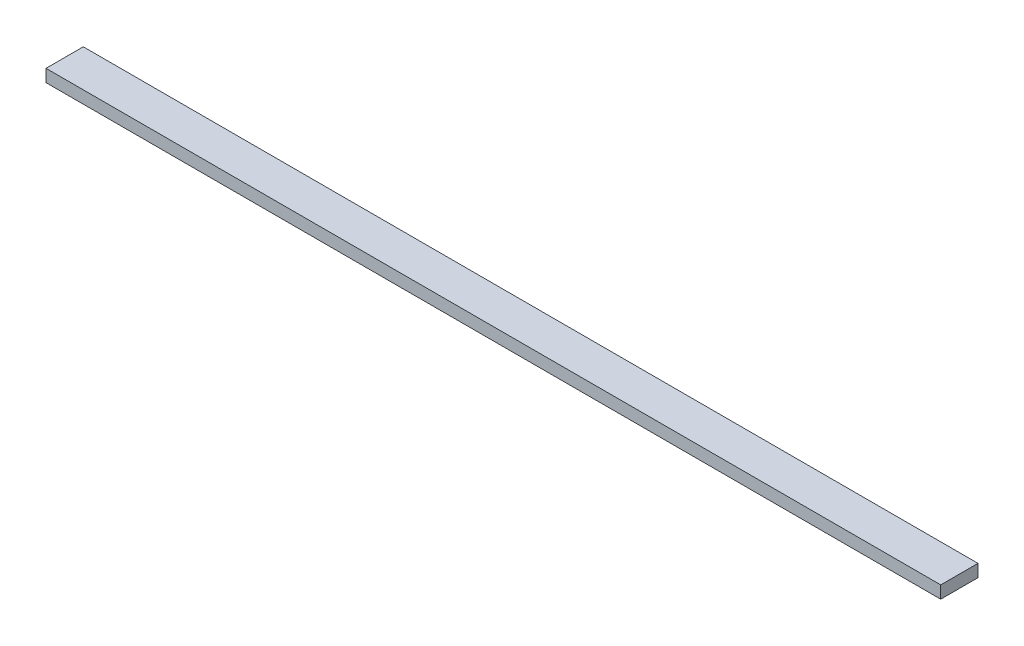
ISO-10303-21;
HEADER;
FILE_DESCRIPTION(('STEP AP214'),'2;1');
FILE_NAME('part.step','',(''),(''),'','','');
FILE_SCHEMA(('AUTOMOTIVE_DESIGN { 1 0 10303 214 1 1 1 1 }'));
ENDSEC;
DATA;
#1=APPLICATION_CONTEXT('core data for automotive mechanical design processes');
#2=APPLICATION_PROTOCOL_DEFINITION('international standard','automotive_design',2000,#1);
#3=PRODUCT_CONTEXT('',#1,'mechanical');
#4=PRODUCT('Part','Part','',(#3));
#5=PRODUCT_RELATED_PRODUCT_CATEGORY('part','',(#4));
#6=PRODUCT_DEFINITION_FORMATION('','',#4);
#7=PRODUCT_DEFINITION_CONTEXT('part definition',#1,'design');
#8=PRODUCT_DEFINITION('design','',#6,#7);
#9=PRODUCT_DEFINITION_SHAPE('','',#8);
#10=(LENGTH_UNIT() NAMED_UNIT(*) SI_UNIT(.MILLI.,.METRE.));
#11=(NAMED_UNIT(*) PLANE_ANGLE_UNIT() SI_UNIT($,.RADIAN.));
#12=(NAMED_UNIT(*) SI_UNIT($,.STERADIAN.) SOLID_ANGLE_UNIT());
#13=UNCERTAINTY_MEASURE_WITH_UNIT(LENGTH_MEASURE(1.E-05),#10,'distance_accuracy_value','');
#14=(GEOMETRIC_REPRESENTATION_CONTEXT(3) GLOBAL_UNCERTAINTY_ASSIGNED_CONTEXT((#13)) GLOBAL_UNIT_ASSIGNED_CONTEXT((#10,
#11,#12)) REPRESENTATION_CONTEXT('',''));
#15=CARTESIAN_POINT('',(0.,0.,0.));
#16=DIRECTION('',(0.,0.,1.));
#17=DIRECTION('',(1.,0.,0.));
#18=AXIS2_PLACEMENT_3D('',#15,#16,#17);
#19=CARTESIAN_POINT('',(0.,12.7,0.));
#20=DIRECTION('',(1.,0.,0.));
#21=DIRECTION('',(0.,0.,-1.));
#22=AXIS2_PLACEMENT_3D('',#19,#20,#21);
#23=PLANE('',#22);
#24=DIRECTION('',(0.,0.,1.));
#25=VECTOR('',#24,1.);
#26=CARTESIAN_POINT('',(0.,0.,0.));
#27=LINE('',#26,#25);
#28=CARTESIAN_POINT('',(0.,0.,-38.1));
#29=VERTEX_POINT('',#28);
#30=CARTESIAN_POINT('',(0.,0.,0.));
#31=VERTEX_POINT('',#30);
#32=EDGE_CURVE('E98',#29,#31,#27,.T.);
#33=ORIENTED_EDGE('',*,*,#32,.T.);
#34=DIRECTION('',(0.,-1.,0.));
#35=VECTOR('',#34,1.);
#36=CARTESIAN_POINT('',(0.,12.7,0.));
#37=LINE('',#36,#35);
#38=CARTESIAN_POINT('',(0.,12.7,0.));
#39=VERTEX_POINT('',#38);
#40=EDGE_CURVE('E11',#39,#31,#37,.T.);
#41=ORIENTED_EDGE('',*,*,#40,.F.);
#42=DIRECTION('',(0.,0.,1.));
#43=VECTOR('',#42,1.);
#44=CARTESIAN_POINT('',(0.,12.7,0.));
#45=LINE('',#44,#43);
#46=CARTESIAN_POINT('',(0.,12.7,-38.1));
#47=VERTEX_POINT('',#46);
#48=EDGE_CURVE('E86',#47,#39,#45,.T.);
#49=ORIENTED_EDGE('',*,*,#48,.F.);
#50=DIRECTION('',(0.,-1.,0.));
#51=VECTOR('',#50,1.);
#52=CARTESIAN_POINT('',(0.,12.7,-38.1));
#53=LINE('',#52,#51);
#54=EDGE_CURVE('E94',#47,#29,#53,.T.);
#55=ORIENTED_EDGE('',*,*,#54,.T.);
#56=EDGE_LOOP('',(#33,#41,#49,#55));
#57=FACE_BOUND('',#56,.T.);
#58=ADVANCED_FACE('F35',(#57),#23,.F.);
#59=CARTESIAN_POINT('',(0.,12.7,0.));
#60=DIRECTION('',(0.,0.,-1.));
#61=DIRECTION('',(-1.,0.,0.));
#62=AXIS2_PLACEMENT_3D('',#59,#60,#61);
#63=PLANE('',#62);
#64=DIRECTION('',(1.,0.,0.));
#65=VECTOR('',#64,1.);
#66=CARTESIAN_POINT('',(0.,0.,0.));
#67=LINE('',#66,#65);
#68=CARTESIAN_POINT('',(914.4,0.,0.));
#69=VERTEX_POINT('',#68);
#70=EDGE_CURVE('E90',#31,#69,#67,.T.);
#71=ORIENTED_EDGE('',*,*,#70,.T.);
#72=DIRECTION('',(0.,-1.,0.));
#73=VECTOR('',#72,1.);
#74=CARTESIAN_POINT('',(914.4,12.7,0.));
#75=LINE('',#74,#73);
#76=CARTESIAN_POINT('',(914.4,12.7,0.));
#77=VERTEX_POINT('',#76);
#78=EDGE_CURVE('E43',#77,#69,#75,.T.);
#79=ORIENTED_EDGE('',*,*,#78,.F.);
#80=DIRECTION('',(1.,0.,0.));
#81=VECTOR('',#80,1.);
#82=CARTESIAN_POINT('',(0.,12.7,0.));
#83=LINE('',#82,#81);
#84=EDGE_CURVE('E81',#39,#77,#83,.T.);
#85=ORIENTED_EDGE('',*,*,#84,.F.);
#86=ORIENTED_EDGE('',*,*,#40,.T.);
#87=EDGE_LOOP('',(#71,#79,#85,#86));
#88=FACE_BOUND('',#87,.T.);
#89=ADVANCED_FACE('F89',(#88),#63,.F.);
#90=CARTESIAN_POINT('',(914.4,12.7,0.));
#91=DIRECTION('',(-1.,0.,0.));
#92=DIRECTION('',(0.,0.,1.));
#93=AXIS2_PLACEMENT_3D('',#90,#91,#92);
#94=PLANE('',#93);
#95=DIRECTION('',(0.,0.,-1.));
#96=VECTOR('',#95,1.);
#97=CARTESIAN_POINT('',(914.4,0.,0.));
#98=LINE('',#97,#96);
#99=CARTESIAN_POINT('',(914.4,0.,-38.1));
#100=VERTEX_POINT('',#99);
#101=EDGE_CURVE('E68',#69,#100,#98,.T.);
#102=ORIENTED_EDGE('',*,*,#101,.T.);
#103=DIRECTION('',(0.,-1.,0.));
#104=VECTOR('',#103,1.);
#105=CARTESIAN_POINT('',(914.4,12.7,-38.1));
#106=LINE('',#105,#104);
#107=CARTESIAN_POINT('',(914.4,12.7,-38.1));
#108=VERTEX_POINT('',#107);
#109=EDGE_CURVE('E91',#108,#100,#106,.T.);
#110=ORIENTED_EDGE('',*,*,#109,.F.);
#111=DIRECTION('',(0.,0.,-1.));
#112=VECTOR('',#111,1.);
#113=CARTESIAN_POINT('',(914.4,12.7,0.));
#114=LINE('',#113,#112);
#115=EDGE_CURVE('E84',#77,#108,#114,.T.);
#116=ORIENTED_EDGE('',*,*,#115,.F.);
#117=ORIENTED_EDGE('',*,*,#78,.T.);
#118=EDGE_LOOP('',(#102,#110,#116,#117));
#119=FACE_BOUND('',#118,.T.);
#120=ADVANCED_FACE('F92',(#119),#94,.F.);
#121=CARTESIAN_POINT('',(0.,12.7,-38.1));
#122=DIRECTION('',(0.,0.,1.));
#123=DIRECTION('',(1.,0.,0.));
#124=AXIS2_PLACEMENT_3D('',#121,#122,#123);
#125=PLANE('',#124);
#126=DIRECTION('',(-1.,0.,0.));
#127=VECTOR('',#126,1.);
#128=CARTESIAN_POINT('',(0.,0.,-38.1));
#129=LINE('',#128,#127);
#130=EDGE_CURVE('E74',#100,#29,#129,.T.);
#131=ORIENTED_EDGE('',*,*,#130,.T.);
#132=ORIENTED_EDGE('',*,*,#54,.F.);
#133=DIRECTION('',(-1.,0.,0.));
#134=VECTOR('',#133,1.);
#135=CARTESIAN_POINT('',(0.,12.7,-38.1));
#136=LINE('',#135,#134);
#137=EDGE_CURVE('E51',#108,#47,#136,.T.);
#138=ORIENTED_EDGE('',*,*,#137,.F.);
#139=ORIENTED_EDGE('',*,*,#109,.T.);
#140=EDGE_LOOP('',(#131,#132,#138,#139));
#141=FACE_BOUND('',#140,.T.);
#142=ADVANCED_FACE('F105',(#141),#125,.F.);
#143=CARTESIAN_POINT('',(0.,12.7,-38.1));
#144=DIRECTION('',(0.,-1.,0.));
#145=DIRECTION('',(0.,0.,-1.));
#146=AXIS2_PLACEMENT_3D('',#143,#144,#145);
#147=PLANE('',#146);
#148=ORIENTED_EDGE('',*,*,#48,.T.);
#149=ORIENTED_EDGE('',*,*,#84,.T.);
#150=ORIENTED_EDGE('',*,*,#115,.T.);
#151=ORIENTED_EDGE('',*,*,#137,.T.);
#152=EDGE_LOOP('',(#148,#149,#150,#151));
#153=FACE_BOUND('',#152,.T.);
#154=ADVANCED_FACE('F82',(#153),#147,.F.);
#155=CARTESIAN_POINT('',(0.,0.,-38.1));
#156=DIRECTION('',(0.,-1.,0.));
#157=DIRECTION('',(0.,0.,-1.));
#158=AXIS2_PLACEMENT_3D('',#155,#156,#157);
#159=PLANE('',#158);
#160=ORIENTED_EDGE('',*,*,#32,.F.);
#161=ORIENTED_EDGE('',*,*,#130,.F.);
#162=ORIENTED_EDGE('',*,*,#101,.F.);
#163=ORIENTED_EDGE('',*,*,#70,.F.);
#164=EDGE_LOOP('',(#160,#161,#162,#163));
#165=FACE_BOUND('',#164,.T.);
#166=ADVANCED_FACE('F108',(#165),#159,.T.);
#167=CLOSED_SHELL('',(#58,#89,#120,#142,#154,#166));
#168=MANIFOLD_SOLID_BREP('B2',#167);
#169=ADVANCED_BREP_SHAPE_REPRESENTATION('',(#18,#168),#14);
#170=SHAPE_DEFINITION_REPRESENTATION(#9,#169);
ENDSEC;
END-ISO-10303-21;
